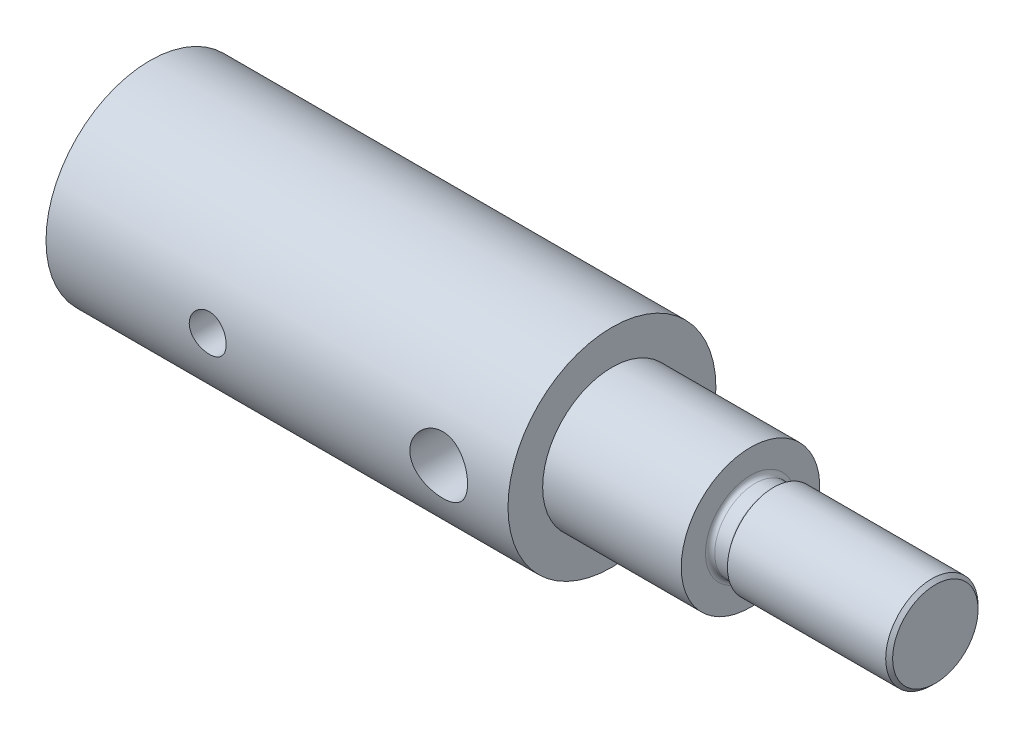
ISO-10303-21;
HEADER;
FILE_DESCRIPTION(('STEP AP214'),'2;1');
FILE_NAME('part.step','',(''),(''),'','','');
FILE_SCHEMA(('AUTOMOTIVE_DESIGN { 1 0 10303 214 1 1 1 1 }'));
ENDSEC;
DATA;
#1=APPLICATION_CONTEXT('core data for automotive mechanical design processes');
#2=APPLICATION_PROTOCOL_DEFINITION('international standard','automotive_design',2000,#1);
#3=PRODUCT_CONTEXT('',#1,'mechanical');
#4=PRODUCT('Part','Part','',(#3));
#5=PRODUCT_RELATED_PRODUCT_CATEGORY('part','',(#4));
#6=PRODUCT_DEFINITION_FORMATION('','',#4);
#7=PRODUCT_DEFINITION_CONTEXT('part definition',#1,'design');
#8=PRODUCT_DEFINITION('design','',#6,#7);
#9=PRODUCT_DEFINITION_SHAPE('','',#8);
#10=(LENGTH_UNIT() NAMED_UNIT(*) SI_UNIT(.MILLI.,.METRE.));
#11=(NAMED_UNIT(*) PLANE_ANGLE_UNIT() SI_UNIT($,.RADIAN.));
#12=(NAMED_UNIT(*) SI_UNIT($,.STERADIAN.) SOLID_ANGLE_UNIT());
#13=UNCERTAINTY_MEASURE_WITH_UNIT(LENGTH_MEASURE(1.E-05),#10,'distance_accuracy_value','');
#14=(GEOMETRIC_REPRESENTATION_CONTEXT(3) GLOBAL_UNCERTAINTY_ASSIGNED_CONTEXT((#13)) GLOBAL_UNIT_ASSIGNED_CONTEXT((#10,
#11,#12)) REPRESENTATION_CONTEXT('',''));
#15=CARTESIAN_POINT('',(0.,0.,0.));
#16=DIRECTION('',(0.,0.,1.));
#17=DIRECTION('',(1.,0.,0.));
#18=AXIS2_PLACEMENT_3D('',#15,#16,#17);
#19=CARTESIAN_POINT('',(0.,0.,0.));
#20=DIRECTION('',(-1.,0.,0.));
#21=DIRECTION('',(0.,0.,1.));
#22=AXIS2_PLACEMENT_3D('',#19,#20,#21);
#23=CYLINDRICAL_SURFACE('',#22,4.5);
#24=CARTESIAN_POINT('',(18.25,0.,-4.5));
#25=CARTESIAN_POINT('',(18.2499986004148,0.0688012508831791,-4.49999908016929));
#26=CARTESIAN_POINT('',(18.2443006801947,0.137617123752667,-4.49840674086833));
#27=CARTESIAN_POINT('',(18.2217042717347,0.273259475994238,-4.49220950198236));
#28=CARTESIAN_POINT('',(18.2048010582863,0.340085103663439,-4.48760333149253));
#29=CARTESIAN_POINT('',(18.1603912805861,0.469769949680302,-4.47588565394594));
#30=CARTESIAN_POINT('',(18.1328990313016,0.53263439009567,-4.46877753030963));
#31=CARTESIAN_POINT('',(18.0681464936731,0.652860695241773,-4.45280312581996));
#32=CARTESIAN_POINT('',(18.0308853380807,0.710222070812298,-4.44393668888688));
#33=CARTESIAN_POINT('',(17.9466705661571,0.819246784715926,-4.4251515781749));
#34=CARTESIAN_POINT('',(17.8995179603125,0.870753112808476,-4.41521373623696));
#35=CARTESIAN_POINT('',(17.7972837228784,0.96523818569634,-4.39552607117256));
#36=CARTESIAN_POINT('',(17.7422009777248,1.00821573084554,-4.38577627467017));
#37=CARTESIAN_POINT('',(17.6243927398707,1.08520808580324,-4.36737044294547));
#38=CARTESIAN_POINT('',(17.5615427915563,1.11903874947837,-4.35873847945984));
#39=CARTESIAN_POINT('',(17.4307680823599,1.1755895713114,-4.34382900808304));
#40=CARTESIAN_POINT('',(17.3628443495918,1.19831197336242,-4.33755102474248));
#41=CARTESIAN_POINT('',(17.2255972111459,1.23144924367956,-4.32825883142877));
#42=CARTESIAN_POINT('',(17.1563481783601,1.24215036904297,-4.32516886003198));
#43=CARTESIAN_POINT('',(17.0169741144372,1.25183427077973,-4.32237649384803));
#44=CARTESIAN_POINT('',(16.9468492651188,1.25081944027303,-4.3226734072502));
#45=CARTESIAN_POINT('',(16.8099777212773,1.2373267133762,-4.32655366801453));
#46=CARTESIAN_POINT('',(16.7431931985038,1.22519902270671,-4.33003660668585));
#47=CARTESIAN_POINT('',(16.6126463714084,1.19038731201905,-4.33973517053475));
#48=CARTESIAN_POINT('',(16.5488843273977,1.16770238457158,-4.3459510306134));
#49=CARTESIAN_POINT('',(16.4252977685447,1.11214373134465,-4.36050069775752));
#50=CARTESIAN_POINT('',(16.3655301331899,1.07915021836991,-4.36885918600197));
#51=CARTESIAN_POINT('',(16.2522584244088,1.00399440679636,-4.386739506843));
#52=CARTESIAN_POINT('',(16.1987556812739,0.961830166290603,-4.39626158564315));
#53=CARTESIAN_POINT('',(16.0975361195636,0.867755610284442,-4.41581072126827));
#54=CARTESIAN_POINT('',(16.0500923651201,0.815552279702357,-4.42584370037791));
#55=CARTESIAN_POINT('',(15.9645742692222,0.703806607201037,-4.44498199810828));
#56=CARTESIAN_POINT('',(15.9265003618975,0.644263925421967,-4.45408727373461));
#57=CARTESIAN_POINT('',(15.8606681843699,0.519083429338117,-4.47040839712755));
#58=CARTESIAN_POINT('',(15.8329628960611,0.45341639574775,-4.47761448645532));
#59=CARTESIAN_POINT('',(15.7890659015586,0.318109988769717,-4.48925492501446));
#60=CARTESIAN_POINT('',(15.7728714578434,0.248471564121132,-4.49368993323699));
#61=CARTESIAN_POINT('',(15.752892863221,0.109526607713143,-4.49918736483408));
#62=CARTESIAN_POINT('',(15.7487378550928,0.0402773058586817,-4.5003505382403));
#63=CARTESIAN_POINT('',(15.7519269982924,-0.0979299306365674,-4.49946480293159));
#64=CARTESIAN_POINT('',(15.759269851648,-0.166887897284519,-4.49741625678167));
#65=CARTESIAN_POINT('',(15.7849433341196,-0.30120691347086,-4.49040265059029));
#66=CARTESIAN_POINT('',(15.8030639450575,-0.366611288163867,-4.4854933716758));
#67=CARTESIAN_POINT('',(15.8495318676381,-0.49344311811872,-4.47331829169354));
#68=CARTESIAN_POINT('',(15.8778803325695,-0.554870123972382,-4.46605222488463));
#69=CARTESIAN_POINT('',(15.9446658780465,-0.673420140405416,-4.44973740284175));
#70=CARTESIAN_POINT('',(15.9833005243227,-0.730427061953541,-4.44065471340565));
#71=CARTESIAN_POINT('',(16.0693161358075,-0.837277670586999,-4.42175477128212));
#72=CARTESIAN_POINT('',(16.1166989800658,-0.887119814631375,-4.41193736105189));
#73=CARTESIAN_POINT('',(16.2206014438783,-0.979812026944952,-4.39229842684379));
#74=CARTESIAN_POINT('',(16.2773574515576,-1.02239957885383,-4.3824860820796));
#75=CARTESIAN_POINT('',(16.3974206378797,-1.09745581429008,-4.36429693304267));
#76=CARTESIAN_POINT('',(16.4607275658426,-1.12992488482463,-4.35592007387163));
#77=CARTESIAN_POINT('',(16.5918071698832,-1.18358105834153,-4.34164798956173));
#78=CARTESIAN_POINT('',(16.6595526377546,-1.20483077484783,-4.3357390309604));
#79=CARTESIAN_POINT('',(16.7978497094168,-1.23557652495357,-4.32707876892783));
#80=CARTESIAN_POINT('',(16.8684005146331,-1.24507587906573,-4.32432657344886));
#81=CARTESIAN_POINT('',(17.0076057794908,-1.25184859974322,-4.32237038329875));
#82=CARTESIAN_POINT('',(17.0762381900119,-1.24954571014582,-4.32304340461176));
#83=CARTESIAN_POINT('',(17.2120948937947,-1.23377143287258,-4.32757137052123));
#84=CARTESIAN_POINT('',(17.2793192292682,-1.22030038049411,-4.33142621959091));
#85=CARTESIAN_POINT('',(17.4098672339181,-1.18282724248615,-4.34180718808003));
#86=CARTESIAN_POINT('',(17.4732208426478,-1.15892214641117,-4.34830866913275));
#87=CARTESIAN_POINT('',(17.5950674225073,-1.10133451670734,-4.36324916052054));
#88=CARTESIAN_POINT('',(17.6535595714857,-1.06765033358688,-4.37168849767404));
#89=CARTESIAN_POINT('',(17.7660276528252,-0.990206962020973,-4.38988810785379));
#90=CARTESIAN_POINT('',(17.8198014766827,-0.946162084346267,-4.39968178982262));
#91=CARTESIAN_POINT('',(17.9193323720535,-0.849781527450664,-4.41930831909362));
#92=CARTESIAN_POINT('',(17.965087452891,-0.797443795628193,-4.4291411755031));
#93=CARTESIAN_POINT('',(18.0483581365781,-0.684460232307883,-4.44801839581548));
#94=CARTESIAN_POINT('',(18.0856516233107,-0.623646258932176,-4.45703841192791));
#95=CARTESIAN_POINT('',(18.1494281392895,-0.496361982692843,-4.47299974900605));
#96=CARTESIAN_POINT('',(18.175917518581,-0.429895030176726,-4.47994229035335));
#97=CARTESIAN_POINT('',(18.2142200807347,-0.303145483766701,-4.4901607483195));
#98=CARTESIAN_POINT('',(18.2276047875929,-0.243364402168742,-4.49382245661855));
#99=CARTESIAN_POINT('',(18.2454948458225,-0.12239262569341,-4.49874234976285));
#100=CARTESIAN_POINT('',(18.2500012449999,-0.0612020980194156,-4.50000081823467));
#101=CARTESIAN_POINT('',(18.25,0.,-4.5));
#102=B_SPLINE_CURVE_WITH_KNOTS('',3,(#24,#25,#26,#27,#28,#29,#30,#31,#32,#33,#34,#35,#36,#37,
#38,#39,#40,#41,#42,#43,#44,#45,#46,#47,#48,#49,#50,#51,#52,#53,#54,#55,#56,#57,#58,#59,#60,#61,
#62,#63,#64,#65,#66,#67,#68,#69,#70,#71,#72,#73,#74,#75,#76,#77,#78,#79,#80,#81,#82,#83,#84,#85,
#86,#87,#88,#89,#90,#91,#92,#93,#94,#95,#96,#97,#98,#99,#100,#101),.UNSPECIFIED.,.T.,.F.,(4,2,2,
2,2,2,2,2,2,2,2,2,2,2,2,2,2,2,2,2,2,2,2,2,2,2,2,2,2,2,2,2,2,2,2,2,2,2,4),(0.,0.20617919309949,
0.412445386147261,0.618433707942855,0.824440322837931,1.03507624325265,1.24574177043995,
1.46037690323672,1.67496866133384,1.88433431939189,2.09365721284145,2.29660232990422,
2.49956489399153,2.70497960040656,2.91043784592675,3.12319493838162,3.33596188658146,
3.5498016563595,3.76359055350007,3.97072010588427,4.17782627748478,4.38102317477487,
4.58424299163039,4.79168948884227,4.99918059600964,5.21305991702851,5.426931056682,
5.63959564853972,5.85220013017267,6.05722599244308,6.26224569952549,6.46539893556025,
6.66858645848129,6.87821913273771,7.0879037754062,7.30258090584733,7.51713167871719,
7.7005598652503,7.88396640253935),.UNSPECIFIED.);
#103=CARTESIAN_POINT('',(18.25,0.,-4.5));
#104=VERTEX_POINT('',#103);
#105=EDGE_CURVE('E11',#104,#104,#102,.T.);
#106=ORIENTED_EDGE('',*,*,#105,.T.);
#107=EDGE_LOOP('',(#106));
#108=FACE_BOUND('',#107,.T.);
#109=CARTESIAN_POINT('',(18.25,0.,4.5));
#110=CARTESIAN_POINT('',(18.2499986004148,-0.0688012508831791,4.49999908016929));
#111=CARTESIAN_POINT('',(18.2443006801947,-0.137617123752667,4.49840674086833));
#112=CARTESIAN_POINT('',(18.2217042717347,-0.273259475994238,4.49220950198236));
#113=CARTESIAN_POINT('',(18.2048010582863,-0.340085103663439,4.48760333149253));
#114=CARTESIAN_POINT('',(18.1603912805861,-0.469769949680302,4.47588565394594));
#115=CARTESIAN_POINT('',(18.1328990313016,-0.53263439009567,4.46877753030963));
#116=CARTESIAN_POINT('',(18.0681464936731,-0.652860695241773,4.45280312581996));
#117=CARTESIAN_POINT('',(18.0308853380807,-0.710222070812298,4.44393668888688));
#118=CARTESIAN_POINT('',(17.9466705661571,-0.819246784715924,4.4251515781749));
#119=CARTESIAN_POINT('',(17.8995179603125,-0.870753112808474,4.41521373623696));
#120=CARTESIAN_POINT('',(17.7972837228784,-0.965238185696338,4.39552607117256));
#121=CARTESIAN_POINT('',(17.7422009777248,-1.00821573084554,4.38577627467017));
#122=CARTESIAN_POINT('',(17.6243927398707,-1.08520808580323,4.36737044294547));
#123=CARTESIAN_POINT('',(17.5615427915563,-1.11903874947837,4.35873847945984));
#124=CARTESIAN_POINT('',(17.4307680823599,-1.1755895713114,4.34382900808304));
#125=CARTESIAN_POINT('',(17.3628443495918,-1.19831197336242,4.33755102474248));
#126=CARTESIAN_POINT('',(17.2255972111459,-1.23144924367956,4.32825883142877));
#127=CARTESIAN_POINT('',(17.1563481783601,-1.24215036904297,4.32516886003198));
#128=CARTESIAN_POINT('',(17.0169741144372,-1.25183427077973,4.32237649384803));
#129=CARTESIAN_POINT('',(16.9468492651188,-1.25081944027303,4.3226734072502));
#130=CARTESIAN_POINT('',(16.8099777212773,-1.2373267133762,4.32655366801453));
#131=CARTESIAN_POINT('',(16.7431931985038,-1.22519902270671,4.33003660668585));
#132=CARTESIAN_POINT('',(16.6126463714084,-1.19038731201905,4.33973517053475));
#133=CARTESIAN_POINT('',(16.5488843273977,-1.16770238457158,4.3459510306134));
#134=CARTESIAN_POINT('',(16.4252977685447,-1.11214373134465,4.36050069775752));
#135=CARTESIAN_POINT('',(16.3655301331899,-1.07915021836991,4.36885918600197));
#136=CARTESIAN_POINT('',(16.2522584244088,-1.00399440679636,4.386739506843));
#137=CARTESIAN_POINT('',(16.1987556812739,-0.961830166290603,4.39626158564315));
#138=CARTESIAN_POINT('',(16.0975361195636,-0.867755610284442,4.41581072126827));
#139=CARTESIAN_POINT('',(16.0500923651201,-0.815552279702357,4.42584370037791));
#140=CARTESIAN_POINT('',(15.9645742692222,-0.703806607201037,4.44498199810828));
#141=CARTESIAN_POINT('',(15.9265003618975,-0.644263925421967,4.45408727373461));
#142=CARTESIAN_POINT('',(15.8606681843699,-0.519083429338117,4.47040839712755));
#143=CARTESIAN_POINT('',(15.8329628960611,-0.45341639574775,4.47761448645532));
#144=CARTESIAN_POINT('',(15.7890659015586,-0.318109988769717,4.48925492501446));
#145=CARTESIAN_POINT('',(15.7728714578434,-0.248471564121132,4.49368993323699));
#146=CARTESIAN_POINT('',(15.752892863221,-0.109526607713143,4.49918736483408));
#147=CARTESIAN_POINT('',(15.7487378550928,-0.0402773058586817,4.5003505382403));
#148=CARTESIAN_POINT('',(15.7519269982924,0.0979299306365674,4.49946480293159));
#149=CARTESIAN_POINT('',(15.759269851648,0.166887897284519,4.49741625678167));
#150=CARTESIAN_POINT('',(15.7849433341196,0.30120691347086,4.49040265059029));
#151=CARTESIAN_POINT('',(15.8030639450575,0.366611288163867,4.4854933716758));
#152=CARTESIAN_POINT('',(15.8495318676381,0.49344311811872,4.47331829169354));
#153=CARTESIAN_POINT('',(15.8778803325695,0.554870123972382,4.46605222488463));
#154=CARTESIAN_POINT('',(15.9446658780465,0.673420140405416,4.44973740284175));
#155=CARTESIAN_POINT('',(15.9833005243227,0.730427061953541,4.44065471340565));
#156=CARTESIAN_POINT('',(16.0693161358075,0.837277670586999,4.42175477128212));
#157=CARTESIAN_POINT('',(16.1166989800658,0.887119814631375,4.41193736105189));
#158=CARTESIAN_POINT('',(16.2206014438783,0.979812026944952,4.39229842684379));
#159=CARTESIAN_POINT('',(16.2773574515576,1.02239957885383,4.3824860820796));
#160=CARTESIAN_POINT('',(16.3974206378797,1.09745581429008,4.36429693304267));
#161=CARTESIAN_POINT('',(16.4607275658426,1.12992488482463,4.35592007387163));
#162=CARTESIAN_POINT('',(16.5918071698832,1.18358105834153,4.34164798956173));
#163=CARTESIAN_POINT('',(16.6595526377546,1.20483077484783,4.3357390309604));
#164=CARTESIAN_POINT('',(16.7978497094168,1.23557652495357,4.32707876892783));
#165=CARTESIAN_POINT('',(16.8684005146331,1.24507587906573,4.32432657344886));
#166=CARTESIAN_POINT('',(17.0076057794908,1.25184859974322,4.32237038329875));
#167=CARTESIAN_POINT('',(17.0762381900119,1.24954571014582,4.32304340461176));
#168=CARTESIAN_POINT('',(17.2120948937947,1.23377143287258,4.32757137052123));
#169=CARTESIAN_POINT('',(17.2793192292682,1.22030038049411,4.33142621959091));
#170=CARTESIAN_POINT('',(17.4098672339181,1.18282724248615,4.34180718808003));
#171=CARTESIAN_POINT('',(17.4732208426478,1.15892214641117,4.34830866913275));
#172=CARTESIAN_POINT('',(17.5950674225073,1.10133451670734,4.36324916052054));
#173=CARTESIAN_POINT('',(17.6535595714857,1.06765033358688,4.37168849767404));
#174=CARTESIAN_POINT('',(17.7660276528252,0.990206962020973,4.38988810785379));
#175=CARTESIAN_POINT('',(17.8198014766827,0.946162084346267,4.39968178982262));
#176=CARTESIAN_POINT('',(17.9193323720535,0.849781527450664,4.41930831909362));
#177=CARTESIAN_POINT('',(17.965087452891,0.797443795628193,4.4291411755031));
#178=CARTESIAN_POINT('',(18.0483581365781,0.684460232307883,4.44801839581548));
#179=CARTESIAN_POINT('',(18.0856516233107,0.623646258932176,4.45703841192791));
#180=CARTESIAN_POINT('',(18.1494281392895,0.496361982692843,4.47299974900605));
#181=CARTESIAN_POINT('',(18.175917518581,0.429895030176726,4.47994229035335));
#182=CARTESIAN_POINT('',(18.2142200807347,0.303145483766701,4.4901607483195));
#183=CARTESIAN_POINT('',(18.2276047875929,0.243364402168742,4.49382245661855));
#184=CARTESIAN_POINT('',(18.2454948458225,0.12239262569341,4.49874234976285));
#185=CARTESIAN_POINT('',(18.2500012449999,0.0612020980194156,4.50000081823468));
#186=CARTESIAN_POINT('',(18.25,0.,4.5));
#187=B_SPLINE_CURVE_WITH_KNOTS('',3,(#109,#110,#111,#112,#113,#114,#115,#116,#117,#118,#119,
#120,#121,#122,#123,#124,#125,#126,#127,#128,#129,#130,#131,#132,#133,#134,#135,#136,#137,#138,
#139,#140,#141,#142,#143,#144,#145,#146,#147,#148,#149,#150,#151,#152,#153,#154,#155,#156,#157,
#158,#159,#160,#161,#162,#163,#164,#165,#166,#167,#168,#169,#170,#171,#172,#173,#174,#175,#176,
#177,#178,#179,#180,#181,#182,#183,#184,#185,#186),.UNSPECIFIED.,.T.,.F.,(4,2,2,2,2,2,2,2,2,2,2,
2,2,2,2,2,2,2,2,2,2,2,2,2,2,2,2,2,2,2,2,2,2,2,2,2,2,2,4),(0.,0.20617919309949,0.412445386147261,
0.618433707942855,0.824440322837931,1.03507624325264,1.24574177043995,1.46037690323672,
1.67496866133384,1.88433431939189,2.09365721284145,2.29660232990422,2.49956489399153,
2.70497960040656,2.91043784592675,3.12319493838162,3.33596188658146,3.5498016563595,
3.76359055350007,3.97072010588427,4.17782627748478,4.38102317477487,4.58424299163039,
4.79168948884227,4.99918059600964,5.21305991702851,5.426931056682,5.63959564853972,
5.85220013017267,6.05722599244308,6.26224569952549,6.46539893556025,6.66858645848129,
6.87821913273771,7.0879037754062,7.30258090584733,7.51713167871719,7.7005598652503,
7.88396640253935),.UNSPECIFIED.);
#188=CARTESIAN_POINT('',(18.25,0.,4.5));
#189=VERTEX_POINT('',#188);
#190=EDGE_CURVE('E47',#189,#189,#187,.T.);
#191=ORIENTED_EDGE('',*,*,#190,.T.);
#192=EDGE_LOOP('',(#191));
#193=FACE_BOUND('',#192,.T.);
#194=CARTESIAN_POINT('',(6.20000000000001,0.,4.5));
#195=CARTESIAN_POINT('',(6.20000174500124,0.0445599944511058,4.4999992105062));
#196=CARTESIAN_POINT('',(6.20373556648194,0.0891431869059652,4.49933127269273));
#197=CARTESIAN_POINT('',(6.21856422299493,0.177056081488532,4.49673108581177));
#198=CARTESIAN_POINT('',(6.22966553814751,0.220384645056034,4.49479772375394));
#199=CARTESIAN_POINT('',(6.25888085396563,0.304503908341068,4.48988323923955));
#200=CARTESIAN_POINT('',(6.27698880684739,0.345296761610666,4.48690302058187));
#201=CARTESIAN_POINT('',(6.31968683870222,0.423260819916551,4.48022133695395));
#202=CARTESIAN_POINT('',(6.34427628948374,0.460432375453759,4.47651994188972));
#203=CARTESIAN_POINT('',(6.39952194520398,0.530505214569471,4.46876053693121));
#204=CARTESIAN_POINT('',(6.43023460469286,0.563361649877269,4.46469942018057));
#205=CARTESIAN_POINT('',(6.49673337361036,0.623483866791267,4.45670168733634));
#206=CARTESIAN_POINT('',(6.53251982534165,0.650749270895478,4.45276507966468));
#207=CARTESIAN_POINT('',(6.60846305347863,0.699098750783088,4.44543195001283));
#208=CARTESIAN_POINT('',(6.6486489092434,0.720137812784376,4.44203943857662));
#209=CARTESIAN_POINT('',(6.73205494879309,0.755149375735973,4.4362220868588));
#210=CARTESIAN_POINT('',(6.77527489810219,0.769122422067297,4.43379717189759));
#211=CARTESIAN_POINT('',(6.86304448235446,0.789462626371859,4.43022068885813));
#212=CARTESIAN_POINT('',(6.90757553607279,0.795907629517034,4.42905609757913));
#213=CARTESIAN_POINT('',(6.9971010308134,0.801250297286223,4.42809279824557));
#214=CARTESIAN_POINT('',(7.04209543422275,0.800148569777006,4.42829398018201));
#215=CARTESIAN_POINT('',(7.13071042803527,0.790492309077643,4.43002762272544));
#216=CARTESIAN_POINT('',(7.17434096040703,0.782025776577776,4.43154436334921));
#217=CARTESIAN_POINT('',(7.25955226972143,0.758018594493089,4.43571357461903));
#218=CARTESIAN_POINT('',(7.30113296752241,0.742477672011249,4.4383660890777));
#219=CARTESIAN_POINT('',(7.38132463119045,0.704675286447835,4.44452467379717));
#220=CARTESIAN_POINT('',(7.41991825435445,0.682377806181796,4.44803529850068));
#221=CARTESIAN_POINT('',(7.49284948045757,0.631720767881608,4.45551146323876));
#222=CARTESIAN_POINT('',(7.52718669337333,0.603360654964094,4.45947704489794));
#223=CARTESIAN_POINT('',(7.59113929793212,0.540906518650161,4.46748507923883));
#224=CARTESIAN_POINT('',(7.62068108452127,0.506737111346533,4.47152782616641));
#225=CARTESIAN_POINT('',(7.67362360818996,0.433887873664048,4.47918301924728));
#226=CARTESIAN_POINT('',(7.6970242949151,0.395208006305101,4.48279546187214));
#227=CARTESIAN_POINT('',(7.73702919901549,0.314362693626078,4.48918923602904));
#228=CARTESIAN_POINT('',(7.75362631613044,0.272193661847006,4.49196969848705));
#229=CARTESIAN_POINT('',(7.77948148040013,0.185605949668321,4.49637940000599));
#230=CARTESIAN_POINT('',(7.7887402272949,0.141187484190129,4.49800874882815));
#231=CARTESIAN_POINT('',(7.79955466386688,0.0519955842873786,4.49991771582439));
#232=CARTESIAN_POINT('',(7.80121129597996,0.00723475484142859,4.50021501989789));
#233=CARTESIAN_POINT('',(7.79704445104301,-0.0819245608493668,4.49947505437087));
#234=CARTESIAN_POINT('',(7.79122130299149,-0.126323062944758,4.49843784346905));
#235=CARTESIAN_POINT('',(7.77234414258762,-0.213181265750265,4.49515637034946));
#236=CARTESIAN_POINT('',(7.75934067796172,-0.255652298730736,4.49292054923401));
#237=CARTESIAN_POINT('',(7.72652631306216,-0.337811503894585,4.48749150787854));
#238=CARTESIAN_POINT('',(7.70671498797359,-0.377499502228665,4.48429822789406));
#239=CARTESIAN_POINT('',(7.66062012846491,-0.45340053552691,4.4772644318922));
#240=CARTESIAN_POINT('',(7.63427425226624,-0.48957513227449,4.47341780117456));
#241=CARTESIAN_POINT('',(7.57594317923791,-0.557025922825162,4.46552096315961));
#242=CARTESIAN_POINT('',(7.54395751244815,-0.588301708003001,4.4614707389171));
#243=CARTESIAN_POINT('',(7.47479982524303,-0.645446143234085,4.4535652344551));
#244=CARTESIAN_POINT('',(7.43757076678499,-0.671246227953773,4.44971283774816));
#245=CARTESIAN_POINT('',(7.35924777147296,-0.716226372534343,4.44269514798421));
#246=CARTESIAN_POINT('',(7.31815396878206,-0.735406662090958,4.43952983108809));
#247=CARTESIAN_POINT('',(7.23345052489493,-0.76650296458845,4.43426684579865));
#248=CARTESIAN_POINT('',(7.1898532088758,-0.778451700039768,4.43216437529796));
#249=CARTESIAN_POINT('',(7.10122937361629,-0.794847677147893,4.42925363059009));
#250=CARTESIAN_POINT('',(7.05620299808857,-0.79929567069313,4.42844522666367));
#251=CARTESIAN_POINT('',(6.9666849115136,-0.800540742354149,4.42822025532186));
#252=CARTESIAN_POINT('',(6.92219471612174,-0.7974458568563,4.42878403402657));
#253=CARTESIAN_POINT('',(6.83437920512749,-0.783928148300325,4.43119656754119));
#254=CARTESIAN_POINT('',(6.79105388417185,-0.773505358923916,4.43304531644491));
#255=CARTESIAN_POINT('',(6.70684824695834,-0.745671304177245,4.43781159096408));
#256=CARTESIAN_POINT('',(6.66596434584432,-0.728270589949581,4.44072750237131));
#257=CARTESIAN_POINT('',(6.5876787859153,-0.686986074147885,4.44730088287819));
#258=CARTESIAN_POINT('',(6.55027733850572,-0.663101879332623,4.45095839695473));
#259=CARTESIAN_POINT('',(6.47947492702759,-0.609147973749612,4.45866451251122));
#260=CARTESIAN_POINT('',(6.4461346919219,-0.578999215356943,4.46271772160394));
#261=CARTESIAN_POINT('',(6.38495007334157,-0.513537820189473,4.47072298312656));
#262=CARTESIAN_POINT('',(6.35710695596798,-0.478223997045135,4.47467501207055));
#263=CARTESIAN_POINT('',(6.30750151094107,-0.403098638391699,4.48206940099772));
#264=CARTESIAN_POINT('',(6.28578944198533,-0.363253483491107,4.48550744558468));
#265=CARTESIAN_POINT('',(6.24940142099613,-0.280434482871198,4.49144447674611));
#266=CARTESIAN_POINT('',(6.23471866721443,-0.23746370816299,4.49394437059121));
#267=CARTESIAN_POINT('',(6.21588678482421,-0.161955352943685,4.49719641064708));
#268=CARTESIAN_POINT('',(6.20993911022775,-0.129866914867117,4.49824197346458));
#269=CARTESIAN_POINT('',(6.20199512143958,-0.0651897831779776,4.4996440496288));
#270=CARTESIAN_POINT('',(6.19999872331762,-0.032601100206077,4.50000057761152));
#271=CARTESIAN_POINT('',(6.20000000000001,0.,4.5));
#272=B_SPLINE_CURVE_WITH_KNOTS('',3,(#194,#195,#196,#197,#198,#199,#200,#201,#202,#203,#204,
#205,#206,#207,#208,#209,#210,#211,#212,#213,#214,#215,#216,#217,#218,#219,#220,#221,#222,#223,
#224,#225,#226,#227,#228,#229,#230,#231,#232,#233,#234,#235,#236,#237,#238,#239,#240,#241,#242,
#243,#244,#245,#246,#247,#248,#249,#250,#251,#252,#253,#254,#255,#256,#257,#258,#259,#260,#261,
#262,#263,#264,#265,#266,#267,#268,#269,#270,#271),.UNSPECIFIED.,.T.,.F.,(4,2,2,2,2,2,2,2,2,2,2,
2,2,2,2,2,2,2,2,2,2,2,2,2,2,2,2,2,2,2,2,2,2,2,2,2,2,2,4),(0.,0.133560787307614,
0.267239204719188,0.400802493989525,0.534352842964275,0.669196734750359,0.804049728093324,
0.939855083372446,1.07564995509549,1.21002782142156,1.34439486413637,1.4771780973117,
1.60996645307989,1.74347550247011,1.87699677653181,2.01240541123725,2.14781515620096,
2.28336585829403,2.41890363358383,2.55263640156711,2.68636328750941,2.81916055309513,
2.95196610682171,3.08609099284346,3.22022706069195,3.35595479969539,3.49167782870151,
3.6267820327491,3.76187269289278,3.89503985407062,4.02820640316768,4.16117234921644,
4.29414636182435,4.42891302912826,4.56371069989326,4.69958324903566,4.83532405729453,
4.9330422270718,5.03075832116593),.UNSPECIFIED.);
#273=CARTESIAN_POINT('',(6.20000000000001,0.,4.5));
#274=VERTEX_POINT('',#273);
#275=EDGE_CURVE('E96',#274,#274,#272,.T.);
#276=ORIENTED_EDGE('',*,*,#275,.T.);
#277=EDGE_LOOP('',(#276));
#278=FACE_BOUND('',#277,.T.);
#279=CARTESIAN_POINT('',(0.,0.,0.));
#280=DIRECTION('',(-1.,0.,0.));
#281=DIRECTION('',(0.,0.,1.));
#282=AXIS2_PLACEMENT_3D('',#279,#280,#281);
#283=CIRCLE('',#282,4.5);
#284=CARTESIAN_POINT('',(0.,0.,4.5));
#285=VERTEX_POINT('',#284);
#286=EDGE_CURVE('E64',#285,#285,#283,.T.);
#287=ORIENTED_EDGE('',*,*,#286,.F.);
#288=EDGE_LOOP('',(#287));
#289=FACE_BOUND('',#288,.T.);
#290=CARTESIAN_POINT('',(20.,0.,0.));
#291=DIRECTION('',(-1.,0.,0.));
#292=DIRECTION('',(0.,0.,1.));
#293=AXIS2_PLACEMENT_3D('',#290,#291,#292);
#294=CIRCLE('',#293,4.5);
#295=CARTESIAN_POINT('',(20.,0.,4.5));
#296=VERTEX_POINT('',#295);
#297=EDGE_CURVE('E83',#296,#296,#294,.T.);
#298=ORIENTED_EDGE('',*,*,#297,.T.);
#299=EDGE_LOOP('',(#298));
#300=FACE_BOUND('',#299,.T.);
#301=ADVANCED_FACE('F36',(#108,#193,#278,#289,#300),#23,.T.);
#302=CARTESIAN_POINT('',(0.,4.5,0.));
#303=DIRECTION('',(1.,0.,0.));
#304=DIRECTION('',(0.,0.,-1.));
#305=AXIS2_PLACEMENT_3D('',#302,#303,#304);
#306=PLANE('',#305);
#307=CARTESIAN_POINT('',(0.,0.,0.));
#308=DIRECTION('',(-1.,0.,0.));
#309=DIRECTION('',(0.,0.,1.));
#310=AXIS2_PLACEMENT_3D('',#307,#308,#309);
#311=CIRCLE('',#310,2.);
#312=CARTESIAN_POINT('',(0.,0.,2.));
#313=VERTEX_POINT('',#312);
#314=EDGE_CURVE('E60',#313,#313,#311,.T.);
#315=ORIENTED_EDGE('',*,*,#314,.F.);
#316=EDGE_LOOP('',(#315));
#317=FACE_BOUND('',#316,.T.);
#318=ORIENTED_EDGE('',*,*,#286,.T.);
#319=EDGE_LOOP('',(#318));
#320=FACE_BOUND('',#319,.T.);
#321=ADVANCED_FACE('F124',(#317,#320),#306,.F.);
#322=CARTESIAN_POINT('',(0.,0.,0.));
#323=DIRECTION('',(-1.,0.,0.));
#324=DIRECTION('',(0.,0.,1.));
#325=AXIS2_PLACEMENT_3D('',#322,#323,#324);
#326=CYLINDRICAL_SURFACE('',#325,2.);
#327=CARTESIAN_POINT('',(7.79999999999999,0.,2.));
#328=CARTESIAN_POINT('',(7.7999960592705,0.0429972021771562,1.99999708490834));
#329=CARTESIAN_POINT('',(7.79651289916464,0.0860690256362687,1.99859717722773));
#330=CARTESIAN_POINT('',(7.7827009185915,0.170998592167157,1.99313381240257));
#331=CARTESIAN_POINT('',(7.77235348836554,0.212852711024498,1.98906311479551));
#332=CARTESIAN_POINT('',(7.74524956877646,0.293981569090959,1.97869683685247));
#333=CARTESIAN_POINT('',(7.7285140615133,0.333264264646781,1.97240854545629));
#334=CARTESIAN_POINT('',(7.68919233066938,0.408428788131344,1.95822644318431));
#335=CARTESIAN_POINT('',(7.66660813803242,0.444311790700394,1.95033318983223));
#336=CARTESIAN_POINT('',(7.61510580057562,0.513400403028154,1.93332354468168));
#337=CARTESIAN_POINT('',(7.58595733750389,0.546424909020082,1.92416918771676));
#338=CARTESIAN_POINT('',(7.52263999860928,0.607270001913885,1.90584230762478));
#339=CARTESIAN_POINT('',(7.4884686811153,0.635088042853408,1.89666977781517));
#340=CARTESIAN_POINT('',(7.41422877190309,0.685949826917146,1.87889116718855));
#341=CARTESIAN_POINT('',(7.37396540559072,0.708725992478184,1.87032846385981));
#342=CARTESIAN_POINT('',(7.28978544063198,0.747101887614854,1.85533458874717));
#343=CARTESIAN_POINT('',(7.24587058886065,0.762705025714328,1.84890240497671));
#344=CARTESIAN_POINT('',(7.15771506656316,0.785559529358341,1.83930543064328));
#345=CARTESIAN_POINT('',(7.11357950576951,0.793157586322253,1.83600568142242));
#346=CARTESIAN_POINT('',(7.02454600067709,0.800869184656005,1.83265601619658));
#347=CARTESIAN_POINT('',(6.97964844214999,0.800986406525282,1.83260450209108));
#348=CARTESIAN_POINT('',(6.89369733141678,0.793995747001811,1.83564200111998));
#349=CARTESIAN_POINT('',(6.85259371423639,0.787390125722048,1.8385127001538));
#350=CARTESIAN_POINT('',(6.77213617759732,0.767978752119121,1.84670475043135));
#351=CARTESIAN_POINT('',(6.73278256475588,0.755171917921846,1.85202652928669));
#352=CARTESIAN_POINT('',(6.65599286552159,0.723477893020422,1.86463794035412));
#353=CARTESIAN_POINT('',(6.61861230437813,0.70447194492612,1.87196551712315));
#354=CARTESIAN_POINT('',(6.54743367345538,0.661002584292879,1.88775246555956));
#355=CARTESIAN_POINT('',(6.51363695623888,0.636537122040331,1.8962122618274));
#356=CARTESIAN_POINT('',(6.4478361084792,0.580620239781768,1.91410694696908));
#357=CARTESIAN_POINT('',(6.4161725082216,0.548774985188249,1.92356665990461));
#358=CARTESIAN_POINT('',(6.35852620879919,0.480125770972073,1.94183929983313));
#359=CARTESIAN_POINT('',(6.33254464103589,0.443320826133769,1.9506520977813));
#360=CARTESIAN_POINT('',(6.28655302103367,0.364831061042333,1.96685872505819));
#361=CARTESIAN_POINT('',(6.26667108752118,0.323064196538587,1.97422108038166));
#362=CARTESIAN_POINT('',(6.23433285556878,0.236409506193149,1.98645931331504));
#363=CARTESIAN_POINT('',(6.22187278497704,0.191523278739867,1.99133645384953));
#364=CARTESIAN_POINT('',(6.20542068183212,0.102758355043126,1.99782455802764));
#365=CARTESIAN_POINT('',(6.20097101829858,0.0589773175942121,1.99961178333406));
#366=CARTESIAN_POINT('',(6.19931475978856,-0.0287381239231278,2.00027391404252));
#367=CARTESIAN_POINT('',(6.202106287381,-0.07267248528957,1.99914957432917));
#368=CARTESIAN_POINT('',(6.2145167010208,-0.157373095648795,1.99423026825501));
#369=CARTESIAN_POINT('',(6.2238231921404,-0.198192996710189,1.99055756538209));
#370=CARTESIAN_POINT('',(6.24857428332393,-0.277654171224311,1.981037765622));
#371=CARTESIAN_POINT('',(6.26401967186748,-0.316295164089937,1.97519038942612));
#372=CARTESIAN_POINT('',(6.30111397587199,-0.391631514326679,1.96166637908325));
#373=CARTESIAN_POINT('',(6.32293818881726,-0.42823120910216,1.95393926391921));
#374=CARTESIAN_POINT('',(6.37197612956226,-0.497377436498619,1.9374934589821));
#375=CARTESIAN_POINT('',(6.39919201716905,-0.529922336304447,1.92877437244108));
#376=CARTESIAN_POINT('',(6.46034800517986,-0.592289217211524,1.91058047055245));
#377=CARTESIAN_POINT('',(6.49461341660249,-0.621789573522422,1.90109376570021));
#378=CARTESIAN_POINT('',(6.56777603320375,-0.67470047896548,1.88296669166853));
#379=CARTESIAN_POINT('',(6.60667400013598,-0.698110024534999,1.87432646210604));
#380=CARTESIAN_POINT('',(6.68858467783765,-0.738323000772646,1.85885719963084));
#381=CARTESIAN_POINT('',(6.73163359968493,-0.755060237813776,1.85204652353915));
#382=CARTESIAN_POINT('',(6.82029346068607,-0.780918487882116,1.84129469391173));
#383=CARTESIAN_POINT('',(6.86590248232497,-0.79004512210772,1.837351422784));
#384=CARTESIAN_POINT('',(6.95485116070982,-0.799886246911354,1.83308703719971));
#385=CARTESIAN_POINT('',(6.99811793583734,-0.80115883292114,1.83252568403269));
#386=CARTESIAN_POINT('',(7.08421794308532,-0.796721263711003,1.83445934413239));
#387=CARTESIAN_POINT('',(7.12705122956103,-0.791011995165506,1.83695396929918));
#388=CARTESIAN_POINT('',(7.20933287594202,-0.773228546461452,1.84450659631609));
#389=CARTESIAN_POINT('',(7.2488481097732,-0.761414997428384,1.8494593273098));
#390=CARTESIAN_POINT('',(7.32535145184539,-0.732002179396398,1.86129600493079));
#391=CARTESIAN_POINT('',(7.36233885875993,-0.714401312557518,1.86818048482403));
#392=CARTESIAN_POINT('',(7.43504384770831,-0.672749105103885,1.88359443841797));
#393=CARTESIAN_POINT('',(7.47056746805219,-0.648386134063789,1.89219552925297));
#394=CARTESIAN_POINT('',(7.5371973268815,-0.594356847708591,1.90985521748895));
#395=CARTESIAN_POINT('',(7.56830222885132,-0.564688933927242,1.91891395219363));
#396=CARTESIAN_POINT('',(7.62728114130544,-0.498602202508978,1.93717426834958));
#397=CARTESIAN_POINT('',(7.65481492275922,-0.461870400458449,1.94634703184874));
#398=CARTESIAN_POINT('',(7.70333481704865,-0.383960128114306,1.96320162685487));
#399=CARTESIAN_POINT('',(7.72431788486101,-0.34277960181889,1.97088276437163));
#400=CARTESIAN_POINT('',(7.75864888607611,-0.257895224998077,1.98375885926345));
#401=CARTESIAN_POINT('',(7.77213172942413,-0.214252647287874,1.98899745222011));
#402=CARTESIAN_POINT('',(7.7914556483817,-0.125150618512485,1.99657722483746));
#403=CARTESIAN_POINT('',(7.79732097469755,-0.0796974103435622,1.99892759798255));
#404=CARTESIAN_POINT('',(7.7997581523913,-0.0227649191563701,1.99990359801655));
#405=CARTESIAN_POINT('',(7.80000104345167,-0.0113850754963024,2.0000007718767));
#406=CARTESIAN_POINT('',(7.79999999999999,0.,2.));
#407=B_SPLINE_CURVE_WITH_KNOTS('',3,(#327,#328,#329,#330,#331,#332,#333,#334,#335,#336,#337,
#338,#339,#340,#341,#342,#343,#344,#345,#346,#347,#348,#349,#350,#351,#352,#353,#354,#355,#356,
#357,#358,#359,#360,#361,#362,#363,#364,#365,#366,#367,#368,#369,#370,#371,#372,#373,#374,#375,
#376,#377,#378,#379,#380,#381,#382,#383,#384,#385,#386,#387,#388,#389,#390,#391,#392,#393,#394,
#395,#396,#397,#398,#399,#400,#401,#402,#403,#404,#405,#406),.UNSPECIFIED.,.T.,.F.,(4,2,2,2,2,2,
2,2,2,2,2,2,2,2,2,2,2,2,2,2,2,2,2,2,2,2,2,2,2,2,2,2,2,2,2,2,2,2,2,4),(0.,0.128961195157228,
0.258273454403172,0.387164582988629,0.516011014271933,0.650389526801584,0.78483357973764,
0.925261035276861,1.06562169247306,1.19961642123531,1.33354522536194,1.45815331360548,
1.58278314902418,1.70995650519525,1.83717768775272,1.97423339674621,2.11131637135891,
2.25110765265121,2.39082782445514,2.52227673811201,2.65369157428031,2.77920182225744,
2.90472819597516,3.03409405359303,3.16351183799585,3.30147389849763,3.43945867617497,
3.57878018056328,3.71799869058371,3.84719869357096,3.97638229025215,4.10045727419504,
4.22456654322061,4.35578187222673,4.48703680539354,4.62680169413531,4.76663145456209,
4.90385720405323,5.04064500961733,5.07479218358714),.UNSPECIFIED.);
#408=CARTESIAN_POINT('',(7.79999999999999,0.,2.));
#409=VERTEX_POINT('',#408);
#410=EDGE_CURVE('E84',#409,#409,#407,.T.);
#411=ORIENTED_EDGE('',*,*,#410,.T.);
#412=EDGE_LOOP('',(#411));
#413=FACE_BOUND('',#412,.T.);
#414=CARTESIAN_POINT('',(14.,0.,0.));
#415=DIRECTION('',(-1.,0.,0.));
#416=DIRECTION('',(0.,0.,1.));
#417=AXIS2_PLACEMENT_3D('',#414,#415,#416);
#418=CIRCLE('',#417,2.);
#419=CARTESIAN_POINT('',(14.,0.,2.));
#420=VERTEX_POINT('',#419);
#421=EDGE_CURVE('E58',#420,#420,#418,.T.);
#422=ORIENTED_EDGE('',*,*,#421,.F.);
#423=EDGE_LOOP('',(#422));
#424=FACE_BOUND('',#423,.T.);
#425=ORIENTED_EDGE('',*,*,#314,.T.);
#426=EDGE_LOOP('',(#425));
#427=FACE_BOUND('',#426,.T.);
#428=ADVANCED_FACE('F54',(#413,#424,#427),#326,.F.);
#429=CARTESIAN_POINT('',(14.,0.,0.));
#430=DIRECTION('',(-1.,0.,0.));
#431=DIRECTION('',(0.,0.,1.));
#432=AXIS2_PLACEMENT_3D('',#429,#430,#431);
#433=CONICAL_SURFACE('',#432,2.,1.02974425867666);
#434=CARTESIAN_POINT('',(15.2017212380551,0.,0.));
#435=VERTEX_POINT('',#434);
#436=VERTEX_LOOP('',#435);
#437=FACE_BOUND('',#436,.T.);
#438=ORIENTED_EDGE('',*,*,#421,.T.);
#439=EDGE_LOOP('',(#438));
#440=FACE_BOUND('',#439,.T.);
#441=ADVANCED_FACE('F50',(#437,#440),#433,.F.);
#442=CARTESIAN_POINT('',(26.,2.,0.));
#443=DIRECTION('',(-1.,0.,0.));
#444=DIRECTION('',(0.,0.,1.));
#445=AXIS2_PLACEMENT_3D('',#442,#443,#444);
#446=PLANE('',#445);
#447=CARTESIAN_POINT('',(26.,0.,0.));
#448=DIRECTION('',(-1.,0.,0.));
#449=DIRECTION('',(0.,0.,1.));
#450=AXIS2_PLACEMENT_3D('',#447,#448,#449);
#451=CIRCLE('',#450,1.95);
#452=CARTESIAN_POINT('',(26.,0.,1.95));
#453=VERTEX_POINT('',#452);
#454=EDGE_CURVE('E93',#453,#453,#451,.T.);
#455=ORIENTED_EDGE('',*,*,#454,.T.);
#456=EDGE_LOOP('',(#455));
#457=FACE_BOUND('',#456,.T.);
#458=CARTESIAN_POINT('',(26.,0.,0.));
#459=DIRECTION('',(-1.,0.,0.));
#460=DIRECTION('',(0.,0.,1.));
#461=AXIS2_PLACEMENT_3D('',#458,#459,#460);
#462=CIRCLE('',#461,3.);
#463=CARTESIAN_POINT('',(26.,0.,3.));
#464=VERTEX_POINT('',#463);
#465=EDGE_CURVE('E61',#464,#464,#462,.T.);
#466=ORIENTED_EDGE('',*,*,#465,.F.);
#467=EDGE_LOOP('',(#466));
#468=FACE_BOUND('',#467,.T.);
#469=ADVANCED_FACE('F53',(#457,#468),#446,.F.);
#470=CARTESIAN_POINT('',(0.,0.,0.));
#471=DIRECTION('',(-1.,0.,0.));
#472=DIRECTION('',(0.,0.,1.));
#473=AXIS2_PLACEMENT_3D('',#470,#471,#472);
#474=CYLINDRICAL_SURFACE('',#473,3.);
#475=CARTESIAN_POINT('',(20.,0.,0.));
#476=DIRECTION('',(-1.,0.,0.));
#477=DIRECTION('',(0.,0.,1.));
#478=AXIS2_PLACEMENT_3D('',#475,#476,#477);
#479=CIRCLE('',#478,3.);
#480=CARTESIAN_POINT('',(20.,0.,3.));
#481=VERTEX_POINT('',#480);
#482=EDGE_CURVE('E67',#481,#481,#479,.T.);
#483=ORIENTED_EDGE('',*,*,#482,.F.);
#484=EDGE_LOOP('',(#483));
#485=FACE_BOUND('',#484,.T.);
#486=ORIENTED_EDGE('',*,*,#465,.T.);
#487=EDGE_LOOP('',(#486));
#488=FACE_BOUND('',#487,.T.);
#489=ADVANCED_FACE('F146',(#485,#488),#474,.T.);
#490=CARTESIAN_POINT('',(20.,3.,0.));
#491=DIRECTION('',(-1.,0.,0.));
#492=DIRECTION('',(0.,0.,1.));
#493=AXIS2_PLACEMENT_3D('',#490,#491,#492);
#494=PLANE('',#493);
#495=ORIENTED_EDGE('',*,*,#297,.F.);
#496=EDGE_LOOP('',(#495));
#497=FACE_BOUND('',#496,.T.);
#498=ORIENTED_EDGE('',*,*,#482,.T.);
#499=EDGE_LOOP('',(#498));
#500=FACE_BOUND('',#499,.T.);
#501=ADVANCED_FACE('F144',(#497,#500),#494,.F.);
#502=CARTESIAN_POINT('',(27.,2.25,0.));
#503=DIRECTION('',(-1.,0.,0.));
#504=DIRECTION('',(0.,0.,1.));
#505=AXIS2_PLACEMENT_3D('',#502,#503,#504);
#506=PLANE('',#505);
#507=CARTESIAN_POINT('',(27.,0.,0.));
#508=DIRECTION('',(-1.,0.,0.));
#509=DIRECTION('',(0.,0.,1.));
#510=AXIS2_PLACEMENT_3D('',#507,#508,#509);
#511=CIRCLE('',#510,1.95);
#512=CARTESIAN_POINT('',(27.,0.,1.95));
#513=VERTEX_POINT('',#512);
#514=EDGE_CURVE('E90',#513,#513,#511,.F.);
#515=ORIENTED_EDGE('',*,*,#514,.T.);
#516=EDGE_LOOP('',(#515));
#517=FACE_BOUND('',#516,.T.);
#518=CARTESIAN_POINT('',(27.,0.,0.));
#519=DIRECTION('',(-1.,0.,0.));
#520=DIRECTION('',(0.,0.,1.));
#521=AXIS2_PLACEMENT_3D('',#518,#519,#520);
#522=CIRCLE('',#521,2.);
#523=CARTESIAN_POINT('',(27.,0.,2.));
#524=VERTEX_POINT('',#523);
#525=EDGE_CURVE('E80',#524,#524,#522,.T.);
#526=ORIENTED_EDGE('',*,*,#525,.T.);
#527=EDGE_LOOP('',(#526));
#528=FACE_BOUND('',#527,.T.);
#529=ADVANCED_FACE('F113',(#517,#528),#506,.T.);
#530=CARTESIAN_POINT('',(0.,0.,0.));
#531=DIRECTION('',(-1.,0.,0.));
#532=DIRECTION('',(0.,0.,1.));
#533=AXIS2_PLACEMENT_3D('',#530,#531,#532);
#534=CYLINDRICAL_SURFACE('',#533,1.75);
#535=CARTESIAN_POINT('',(26.8,0.,0.));
#536=DIRECTION('',(-1.,0.,0.));
#537=DIRECTION('',(0.,0.,1.));
#538=AXIS2_PLACEMENT_3D('',#535,#536,#537);
#539=CIRCLE('',#538,1.75);
#540=CARTESIAN_POINT('',(26.8,0.,1.75));
#541=VERTEX_POINT('',#540);
#542=EDGE_CURVE('E87',#541,#541,#539,.T.);
#543=ORIENTED_EDGE('',*,*,#542,.T.);
#544=EDGE_LOOP('',(#543));
#545=FACE_BOUND('',#544,.T.);
#546=CARTESIAN_POINT('',(26.2,0.,0.));
#547=DIRECTION('',(-1.,0.,0.));
#548=DIRECTION('',(0.,0.,1.));
#549=AXIS2_PLACEMENT_3D('',#546,#547,#548);
#550=CIRCLE('',#549,1.75);
#551=CARTESIAN_POINT('',(26.2,0.,1.75));
#552=VERTEX_POINT('',#551);
#553=EDGE_CURVE('E79',#552,#552,#550,.F.);
#554=ORIENTED_EDGE('',*,*,#553,.T.);
#555=EDGE_LOOP('',(#554));
#556=FACE_BOUND('',#555,.T.);
#557=ADVANCED_FACE('F166',(#545,#556),#534,.T.);
#558=CARTESIAN_POINT('',(34.,2.,0.));
#559=DIRECTION('',(-1.,0.,0.));
#560=DIRECTION('',(0.,0.,1.));
#561=AXIS2_PLACEMENT_3D('',#558,#559,#560);
#562=PLANE('',#561);
#563=CARTESIAN_POINT('',(34.,0.,0.));
#564=DIRECTION('',(-1.,0.,0.));
#565=DIRECTION('',(0.,0.,1.));
#566=AXIS2_PLACEMENT_3D('',#563,#564,#565);
#567=CIRCLE('',#566,1.85000000000001);
#568=CARTESIAN_POINT('',(34.,0.,1.85000000000001));
#569=VERTEX_POINT('',#568);
#570=EDGE_CURVE('E76',#569,#569,#567,.F.);
#571=ORIENTED_EDGE('',*,*,#570,.T.);
#572=EDGE_LOOP('',(#571));
#573=FACE_BOUND('',#572,.T.);
#574=ADVANCED_FACE('F164',(#573),#562,.F.);
#575=CARTESIAN_POINT('',(33.85,0.,0.));
#576=DIRECTION('',(-1.,0.,0.));
#577=DIRECTION('',(0.,0.,1.));
#578=AXIS2_PLACEMENT_3D('',#575,#576,#577);
#579=CONICAL_SURFACE('',#578,2.,0.785398163397454);
#580=ORIENTED_EDGE('',*,*,#570,.F.);
#581=EDGE_LOOP('',(#580));
#582=FACE_BOUND('',#581,.T.);
#583=CARTESIAN_POINT('',(33.85,0.,0.));
#584=DIRECTION('',(-1.,0.,0.));
#585=DIRECTION('',(0.,0.,1.));
#586=AXIS2_PLACEMENT_3D('',#583,#584,#585);
#587=CIRCLE('',#586,2.);
#588=CARTESIAN_POINT('',(33.85,0.,2.));
#589=VERTEX_POINT('',#588);
#590=EDGE_CURVE('E73',#589,#589,#587,.T.);
#591=ORIENTED_EDGE('',*,*,#590,.F.);
#592=EDGE_LOOP('',(#591));
#593=FACE_BOUND('',#592,.T.);
#594=ADVANCED_FACE('F162',(#582,#593),#579,.T.);
#595=CARTESIAN_POINT('',(0.,0.,0.));
#596=DIRECTION('',(-1.,0.,0.));
#597=DIRECTION('',(0.,0.,1.));
#598=AXIS2_PLACEMENT_3D('',#595,#596,#597);
#599=CYLINDRICAL_SURFACE('',#598,2.);
#600=ORIENTED_EDGE('',*,*,#590,.T.);
#601=EDGE_LOOP('',(#600));
#602=FACE_BOUND('',#601,.T.);
#603=ORIENTED_EDGE('',*,*,#525,.F.);
#604=EDGE_LOOP('',(#603));
#605=FACE_BOUND('',#604,.T.);
#606=ADVANCED_FACE('F159',(#602,#605),#599,.T.);
#607=CARTESIAN_POINT('',(26.8,0.,0.));
#608=DIRECTION('',(-1.,0.,0.));
#609=DIRECTION('',(0.,0.,1.));
#610=AXIS2_PLACEMENT_3D('',#607,#608,#609);
#611=TOROIDAL_SURFACE('',#610,1.95,0.2);
#612=ORIENTED_EDGE('',*,*,#514,.F.);
#613=EDGE_LOOP('',(#612));
#614=FACE_BOUND('',#613,.T.);
#615=ORIENTED_EDGE('',*,*,#542,.F.);
#616=EDGE_LOOP('',(#615));
#617=FACE_BOUND('',#616,.T.);
#618=ADVANCED_FACE('F161',(#614,#617),#611,.F.);
#619=CARTESIAN_POINT('',(26.2,0.,0.));
#620=DIRECTION('',(-1.,0.,0.));
#621=DIRECTION('',(0.,0.,1.));
#622=AXIS2_PLACEMENT_3D('',#619,#620,#621);
#623=TOROIDAL_SURFACE('',#622,1.95,0.2);
#624=ORIENTED_EDGE('',*,*,#553,.F.);
#625=EDGE_LOOP('',(#624));
#626=FACE_BOUND('',#625,.T.);
#627=ORIENTED_EDGE('',*,*,#454,.F.);
#628=EDGE_LOOP('',(#627));
#629=FACE_BOUND('',#628,.T.);
#630=ADVANCED_FACE('F38',(#626,#629),#623,.F.);
#631=CARTESIAN_POINT('',(7.,0.,0.));
#632=DIRECTION('',(0.,0.,-1.));
#633=DIRECTION('',(-1.,0.,0.));
#634=AXIS2_PLACEMENT_3D('',#631,#632,#633);
#635=CYLINDRICAL_SURFACE('',#634,0.799999999999993);
#636=ORIENTED_EDGE('',*,*,#275,.F.);
#637=EDGE_LOOP('',(#636));
#638=FACE_BOUND('',#637,.T.);
#639=ORIENTED_EDGE('',*,*,#410,.F.);
#640=EDGE_LOOP('',(#639));
#641=FACE_BOUND('',#640,.T.);
#642=ADVANCED_FACE('F106',(#638,#641),#635,.F.);
#643=CARTESIAN_POINT('',(17.,0.,-4.5));
#644=DIRECTION('',(0.,0.,1.));
#645=DIRECTION('',(1.,0.,0.));
#646=AXIS2_PLACEMENT_3D('',#643,#644,#645);
#647=CYLINDRICAL_SURFACE('',#646,1.25);
#648=ORIENTED_EDGE('',*,*,#190,.F.);
#649=EDGE_LOOP('',(#648));
#650=FACE_BOUND('',#649,.T.);
#651=ORIENTED_EDGE('',*,*,#105,.F.);
#652=EDGE_LOOP('',(#651));
#653=FACE_BOUND('',#652,.T.);
#654=ADVANCED_FACE('F110',(#650,#653),#647,.F.);
#655=CLOSED_SHELL('',(#301,#321,#428,#441,#469,#489,#501,#529,#557,#574,#594,#606,#618,#630,
#642,#654));
#656=MANIFOLD_SOLID_BREP('B2',#655);
#657=ADVANCED_BREP_SHAPE_REPRESENTATION('',(#18,#656),#14);
#658=SHAPE_DEFINITION_REPRESENTATION(#9,#657);
ENDSEC;
END-ISO-10303-21;
